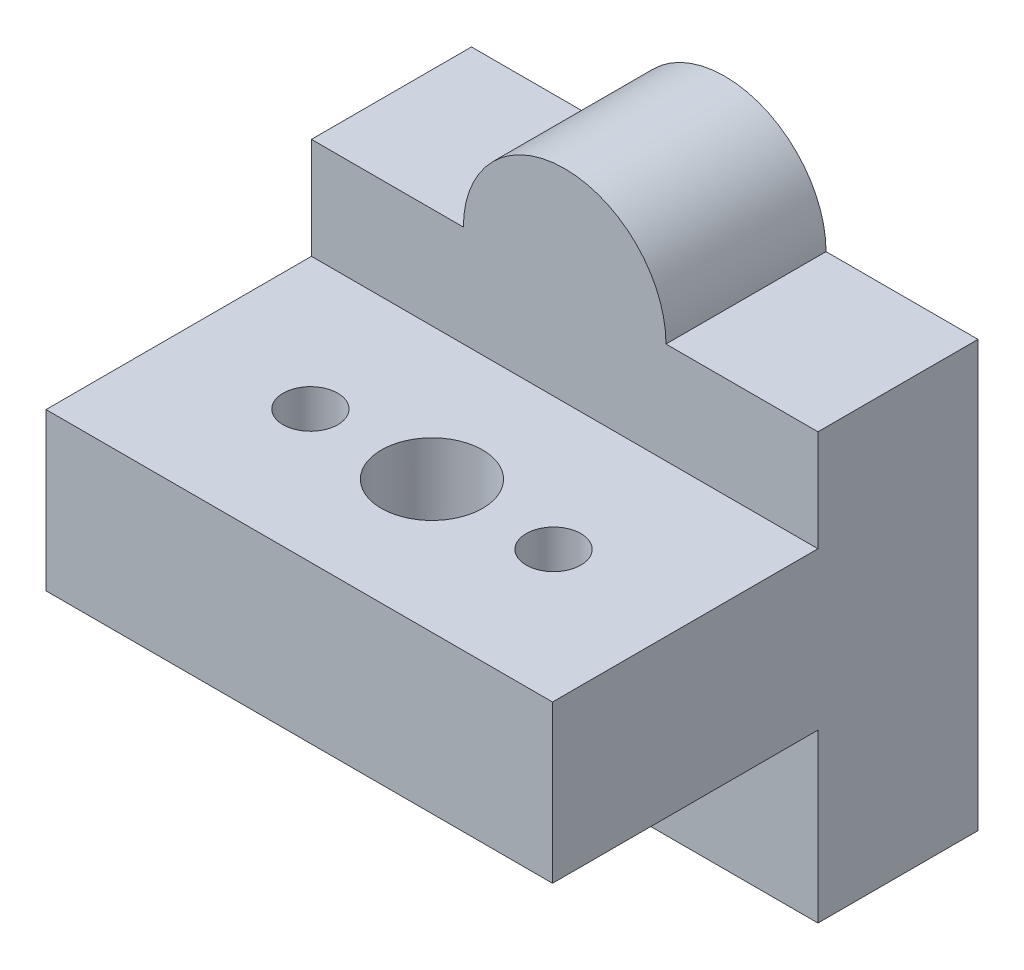
ISO-10303-21;
HEADER;
FILE_DESCRIPTION(('STEP AP214'),'2;1');
FILE_NAME('part.step','',(''),(''),'','','');
FILE_SCHEMA(('AUTOMOTIVE_DESIGN { 1 0 10303 214 1 1 1 1 }'));
ENDSEC;
DATA;
#1=APPLICATION_CONTEXT('core data for automotive mechanical design processes');
#2=APPLICATION_PROTOCOL_DEFINITION('international standard','automotive_design',2000,#1);
#3=PRODUCT_CONTEXT('',#1,'mechanical');
#4=PRODUCT('Part','Part','',(#3));
#5=PRODUCT_RELATED_PRODUCT_CATEGORY('part','',(#4));
#6=PRODUCT_DEFINITION_FORMATION('','',#4);
#7=PRODUCT_DEFINITION_CONTEXT('part definition',#1,'design');
#8=PRODUCT_DEFINITION('design','',#6,#7);
#9=PRODUCT_DEFINITION_SHAPE('','',#8);
#10=(LENGTH_UNIT() NAMED_UNIT(*) SI_UNIT(.MILLI.,.METRE.));
#11=(NAMED_UNIT(*) PLANE_ANGLE_UNIT() SI_UNIT($,.RADIAN.));
#12=(NAMED_UNIT(*) SI_UNIT($,.STERADIAN.) SOLID_ANGLE_UNIT());
#13=UNCERTAINTY_MEASURE_WITH_UNIT(LENGTH_MEASURE(1.E-05),#10,'distance_accuracy_value','');
#14=(GEOMETRIC_REPRESENTATION_CONTEXT(3) GLOBAL_UNCERTAINTY_ASSIGNED_CONTEXT((#13)) GLOBAL_UNIT_ASSIGNED_CONTEXT((#10,
#11,#12)) REPRESENTATION_CONTEXT('',''));
#15=CARTESIAN_POINT('',(0.,0.,0.));
#16=DIRECTION('',(0.,0.,1.));
#17=DIRECTION('',(1.,0.,0.));
#18=AXIS2_PLACEMENT_3D('',#15,#16,#17);
#19=CARTESIAN_POINT('',(6.00015,5.50000001,14.45));
#20=DIRECTION('',(0.,-1.,0.));
#21=DIRECTION('',(1.,0.,0.));
#22=AXIS2_PLACEMENT_3D('',#19,#20,#21);
#23=CYLINDRICAL_SURFACE('',#22,1.349845);
#24=CARTESIAN_POINT('',(6.00015,5.50000001,14.45));
#25=DIRECTION('',(0.,-1.,0.));
#26=DIRECTION('',(1.,0.,0.));
#27=AXIS2_PLACEMENT_3D('',#24,#25,#26);
#28=CIRCLE('',#27,1.349845);
#29=CARTESIAN_POINT('',(7.34999500000001,5.50000001,14.45));
#30=VERTEX_POINT('',#29);
#31=EDGE_CURVE('E251',#30,#30,#28,.F.);
#32=ORIENTED_EDGE('',*,*,#31,.T.);
#33=EDGE_LOOP('',(#32));
#34=FACE_BOUND('',#33,.T.);
#35=CARTESIAN_POINT('',(6.00015,0.250000009999998,14.45));
#36=DIRECTION('',(0.,-1.,0.));
#37=DIRECTION('',(1.,0.,0.));
#38=AXIS2_PLACEMENT_3D('',#35,#36,#37);
#39=CIRCLE('',#38,1.349845);
#40=CARTESIAN_POINT('',(7.34999500000001,0.250000009999999,14.45));
#41=VERTEX_POINT('',#40);
#42=EDGE_CURVE('E436',#41,#41,#39,.F.);
#43=ORIENTED_EDGE('',*,*,#42,.F.);
#44=EDGE_LOOP('',(#43));
#45=FACE_BOUND('',#44,.T.);
#46=ADVANCED_FACE('F140',(#34,#45),#23,.F.);
#47=CARTESIAN_POINT('',(0.,-2.24999999,0.));
#48=DIRECTION('',(0.,-1.,0.));
#49=DIRECTION('',(1.,0.,0.));
#50=AXIS2_PLACEMENT_3D('',#47,#48,#49);
#51=PLANE('',#50);
#52=CARTESIAN_POINT('',(-6.00015,-2.24999999,14.45));
#53=DIRECTION('',(0.,-1.,0.));
#54=DIRECTION('',(1.,0.,0.));
#55=AXIS2_PLACEMENT_3D('',#52,#53,#54);
#56=CIRCLE('',#55,2.6999438);
#57=CARTESIAN_POINT('',(-3.30020619999999,-2.24999999,14.45));
#58=VERTEX_POINT('',#57);
#59=EDGE_CURVE('E456',#58,#58,#56,.F.);
#60=ORIENTED_EDGE('',*,*,#59,.T.);
#61=EDGE_LOOP('',(#60));
#62=FACE_BOUND('',#61,.T.);
#63=CARTESIAN_POINT('',(0.,-2.24999999,14.45));
#64=DIRECTION('',(0.,1.,0.));
#65=DIRECTION('',(-1.,0.,0.));
#66=AXIS2_PLACEMENT_3D('',#63,#64,#65);
#67=CIRCLE('',#66,2.499995);
#68=CARTESIAN_POINT('',(-2.499995,-2.24999999,14.45));
#69=VERTEX_POINT('',#68);
#70=EDGE_CURVE('E438',#69,#69,#67,.T.);
#71=ORIENTED_EDGE('',*,*,#70,.T.);
#72=EDGE_LOOP('',(#71));
#73=FACE_BOUND('',#72,.T.);
#74=DIRECTION('',(-1.,0.,0.));
#75=VECTOR('',#74,1.);
#76=CARTESIAN_POINT('',(12.5,-2.24999999,21.));
#77=LINE('',#76,#75);
#78=CARTESIAN_POINT('',(12.5,-2.24999999,21.));
#79=VERTEX_POINT('',#78);
#80=CARTESIAN_POINT('',(-12.5,-2.24999999,21.));
#81=VERTEX_POINT('',#80);
#82=EDGE_CURVE('E258',#79,#81,#77,.T.);
#83=ORIENTED_EDGE('',*,*,#82,.T.);
#84=DIRECTION('',(0.,0.,1.));
#85=VECTOR('',#84,1.);
#86=CARTESIAN_POINT('',(-12.5,-2.24999999,7.9));
#87=LINE('',#86,#85);
#88=CARTESIAN_POINT('',(-12.5,-2.24999999,7.9));
#89=VERTEX_POINT('',#88);
#90=EDGE_CURVE('E234',#89,#81,#87,.T.);
#91=ORIENTED_EDGE('',*,*,#90,.F.);
#92=DIRECTION('',(-1.,0.,0.));
#93=VECTOR('',#92,1.);
#94=CARTESIAN_POINT('',(12.5,-2.24999999,7.9));
#95=LINE('',#94,#93);
#96=CARTESIAN_POINT('',(12.5,-2.24999999,7.9));
#97=VERTEX_POINT('',#96);
#98=EDGE_CURVE('E248',#97,#89,#95,.T.);
#99=ORIENTED_EDGE('',*,*,#98,.F.);
#100=DIRECTION('',(0.,0.,1.));
#101=VECTOR('',#100,1.);
#102=CARTESIAN_POINT('',(12.5,-2.24999999,7.9));
#103=LINE('',#102,#101);
#104=EDGE_CURVE('E244',#97,#79,#103,.T.);
#105=ORIENTED_EDGE('',*,*,#104,.T.);
#106=EDGE_LOOP('',(#83,#91,#99,#105));
#107=FACE_BOUND('',#106,.T.);
#108=CARTESIAN_POINT('',(6.00015,-2.24999999,14.45));
#109=DIRECTION('',(0.,-1.,0.));
#110=DIRECTION('',(1.,0.,0.));
#111=AXIS2_PLACEMENT_3D('',#108,#109,#110);
#112=CIRCLE('',#111,2.6999438);
#113=CARTESIAN_POINT('',(8.70009380000001,-2.24999999,14.45));
#114=VERTEX_POINT('',#113);
#115=EDGE_CURVE('E445',#114,#114,#112,.F.);
#116=ORIENTED_EDGE('',*,*,#115,.T.);
#117=EDGE_LOOP('',(#116));
#118=FACE_BOUND('',#117,.T.);
#119=ADVANCED_FACE('F374',(#62,#73,#107,#118),#51,.T.);
#120=CARTESIAN_POINT('',(-6.00015,21.24800001,14.45));
#121=DIRECTION('',(0.,-1.,0.));
#122=DIRECTION('',(1.,0.,0.));
#123=AXIS2_PLACEMENT_3D('',#120,#121,#122);
#124=CYLINDRICAL_SURFACE('',#123,1.349845);
#125=CARTESIAN_POINT('',(-6.00015,5.50000001,14.45));
#126=DIRECTION('',(0.,-1.,0.));
#127=DIRECTION('',(1.,0.,0.));
#128=AXIS2_PLACEMENT_3D('',#125,#126,#127);
#129=CIRCLE('',#128,1.349845);
#130=CARTESIAN_POINT('',(-4.650305,5.50000001,14.45));
#131=VERTEX_POINT('',#130);
#132=EDGE_CURVE('E261',#131,#131,#129,.F.);
#133=ORIENTED_EDGE('',*,*,#132,.T.);
#134=EDGE_LOOP('',(#133));
#135=FACE_BOUND('',#134,.T.);
#136=CARTESIAN_POINT('',(-6.00015,0.250000009999998,14.45));
#137=DIRECTION('',(0.,-1.,0.));
#138=DIRECTION('',(1.,0.,0.));
#139=AXIS2_PLACEMENT_3D('',#136,#137,#138);
#140=CIRCLE('',#139,1.349845);
#141=CARTESIAN_POINT('',(-4.650305,0.250000009999998,14.45));
#142=VERTEX_POINT('',#141);
#143=EDGE_CURVE('E451',#142,#142,#140,.F.);
#144=ORIENTED_EDGE('',*,*,#143,.F.);
#145=EDGE_LOOP('',(#144));
#146=FACE_BOUND('',#145,.T.);
#147=ADVANCED_FACE('F380',(#135,#146),#124,.F.);
#148=CARTESIAN_POINT('',(0.,10.5,7.9));
#149=DIRECTION('',(0.,0.,1.));
#150=DIRECTION('',(1.,0.,0.));
#151=AXIS2_PLACEMENT_3D('',#148,#149,#150);
#152=PLANE('',#151);
#153=DIRECTION('',(0.,1.,0.));
#154=VECTOR('',#153,1.);
#155=CARTESIAN_POINT('',(12.5,-10.5,7.9));
#156=LINE('',#155,#154);
#157=CARTESIAN_POINT('',(12.5,-10.5,7.9));
#158=VERTEX_POINT('',#157);
#159=EDGE_CURVE('E164',#158,#97,#156,.T.);
#160=ORIENTED_EDGE('',*,*,#159,.T.);
#161=ORIENTED_EDGE('',*,*,#98,.T.);
#162=DIRECTION('',(0.,-1.,0.));
#163=VECTOR('',#162,1.);
#164=CARTESIAN_POINT('',(-12.5,-10.5,7.9));
#165=LINE('',#164,#163);
#166=CARTESIAN_POINT('',(-12.5,-10.5,7.9));
#167=VERTEX_POINT('',#166);
#168=EDGE_CURVE('E272',#89,#167,#165,.T.);
#169=ORIENTED_EDGE('',*,*,#168,.T.);
#170=DIRECTION('',(1.,0.,0.));
#171=VECTOR('',#170,1.);
#172=CARTESIAN_POINT('',(12.5,-10.5,7.9));
#173=LINE('',#172,#171);
#174=EDGE_CURVE('E271',#167,#158,#173,.T.);
#175=ORIENTED_EDGE('',*,*,#174,.T.);
#176=EDGE_LOOP('',(#160,#161,#169,#175));
#177=FACE_BOUND('',#176,.T.);
#178=ADVANCED_FACE('F385',(#177),#152,.T.);
#179=CARTESIAN_POINT('',(-12.5,-10.5,7.9));
#180=DIRECTION('',(1.,0.,0.));
#181=DIRECTION('',(0.,0.,-1.));
#182=AXIS2_PLACEMENT_3D('',#179,#180,#181);
#183=PLANE('',#182);
#184=DIRECTION('',(0.,-1.,0.));
#185=VECTOR('',#184,1.);
#186=CARTESIAN_POINT('',(-12.5,-10.5,0.));
#187=LINE('',#186,#185);
#188=CARTESIAN_POINT('',(-12.5,10.5,0.));
#189=VERTEX_POINT('',#188);
#190=CARTESIAN_POINT('',(-12.5,-10.5,0.));
#191=VERTEX_POINT('',#190);
#192=EDGE_CURVE('E288',#189,#191,#187,.T.);
#193=ORIENTED_EDGE('',*,*,#192,.T.);
#194=DIRECTION('',(0.,0.,-1.));
#195=VECTOR('',#194,1.);
#196=CARTESIAN_POINT('',(-12.5,-10.5,7.9));
#197=LINE('',#196,#195);
#198=EDGE_CURVE('E12',#167,#191,#197,.T.);
#199=ORIENTED_EDGE('',*,*,#198,.F.);
#200=ORIENTED_EDGE('',*,*,#168,.F.);
#201=ORIENTED_EDGE('',*,*,#90,.T.);
#202=DIRECTION('',(0.,-1.,0.));
#203=VECTOR('',#202,1.);
#204=CARTESIAN_POINT('',(-12.5,5.50000001,21.));
#205=LINE('',#204,#203);
#206=CARTESIAN_POINT('',(-12.5,5.50000001,21.));
#207=VERTEX_POINT('',#206);
#208=EDGE_CURVE('E230',#207,#81,#205,.T.);
#209=ORIENTED_EDGE('',*,*,#208,.F.);
#210=DIRECTION('',(0.,0.,1.));
#211=VECTOR('',#210,1.);
#212=CARTESIAN_POINT('',(-12.5,5.50000001,7.9));
#213=LINE('',#212,#211);
#214=CARTESIAN_POINT('',(-12.5,5.50000001,7.9));
#215=VERTEX_POINT('',#214);
#216=EDGE_CURVE('E218',#215,#207,#213,.T.);
#217=ORIENTED_EDGE('',*,*,#216,.F.);
#218=CARTESIAN_POINT('',(-12.5,10.5,7.9));
#219=VERTEX_POINT('',#218);
#220=EDGE_CURVE('E268',#219,#215,#165,.T.);
#221=ORIENTED_EDGE('',*,*,#220,.F.);
#222=DIRECTION('',(0.,0.,-1.));
#223=VECTOR('',#222,1.);
#224=CARTESIAN_POINT('',(-12.5,10.5,7.9));
#225=LINE('',#224,#223);
#226=EDGE_CURVE('E287',#219,#189,#225,.T.);
#227=ORIENTED_EDGE('',*,*,#226,.T.);
#228=EDGE_LOOP('',(#193,#199,#200,#201,#209,#217,#221,#227));
#229=FACE_BOUND('',#228,.T.);
#230=ADVANCED_FACE('F142',(#229),#183,.F.);
#231=CARTESIAN_POINT('',(12.5,-10.5,7.9));
#232=DIRECTION('',(0.,1.,0.));
#233=DIRECTION('',(-1.,0.,0.));
#234=AXIS2_PLACEMENT_3D('',#231,#232,#233);
#235=PLANE('',#234);
#236=DIRECTION('',(1.,0.,0.));
#237=VECTOR('',#236,1.);
#238=CARTESIAN_POINT('',(12.5,-10.5,0.));
#239=LINE('',#238,#237);
#240=CARTESIAN_POINT('',(12.5,-10.5,0.));
#241=VERTEX_POINT('',#240);
#242=EDGE_CURVE('E291',#191,#241,#239,.T.);
#243=ORIENTED_EDGE('',*,*,#242,.T.);
#244=DIRECTION('',(0.,0.,-1.));
#245=VECTOR('',#244,1.);
#246=CARTESIAN_POINT('',(12.5,-10.5,7.9));
#247=LINE('',#246,#245);
#248=EDGE_CURVE('E149',#158,#241,#247,.T.);
#249=ORIENTED_EDGE('',*,*,#248,.F.);
#250=ORIENTED_EDGE('',*,*,#174,.F.);
#251=ORIENTED_EDGE('',*,*,#198,.T.);
#252=EDGE_LOOP('',(#243,#249,#250,#251));
#253=FACE_BOUND('',#252,.T.);
#254=ADVANCED_FACE('F394',(#253),#235,.F.);
#255=CARTESIAN_POINT('',(12.5,-10.5,7.9));
#256=DIRECTION('',(-1.,0.,0.));
#257=DIRECTION('',(0.,0.,1.));
#258=AXIS2_PLACEMENT_3D('',#255,#256,#257);
#259=PLANE('',#258);
#260=DIRECTION('',(0.,1.,0.));
#261=VECTOR('',#260,1.);
#262=CARTESIAN_POINT('',(12.5,-10.5,0.));
#263=LINE('',#262,#261);
#264=CARTESIAN_POINT('',(12.5,10.5,0.));
#265=VERTEX_POINT('',#264);
#266=EDGE_CURVE('E294',#241,#265,#263,.T.);
#267=ORIENTED_EDGE('',*,*,#266,.T.);
#268=DIRECTION('',(0.,0.,-1.));
#269=VECTOR('',#268,1.);
#270=CARTESIAN_POINT('',(12.5,10.5,7.9));
#271=LINE('',#270,#269);
#272=CARTESIAN_POINT('',(12.5,10.5,7.9));
#273=VERTEX_POINT('',#272);
#274=EDGE_CURVE('E317',#273,#265,#271,.T.);
#275=ORIENTED_EDGE('',*,*,#274,.F.);
#276=CARTESIAN_POINT('',(12.5,5.50000001,7.9));
#277=VERTEX_POINT('',#276);
#278=EDGE_CURVE('E275',#277,#273,#156,.T.);
#279=ORIENTED_EDGE('',*,*,#278,.F.);
#280=DIRECTION('',(0.,0.,1.));
#281=VECTOR('',#280,1.);
#282=CARTESIAN_POINT('',(12.5,5.50000001,7.9));
#283=LINE('',#282,#281);
#284=CARTESIAN_POINT('',(12.5,5.50000001,21.));
#285=VERTEX_POINT('',#284);
#286=EDGE_CURVE('E240',#277,#285,#283,.T.);
#287=ORIENTED_EDGE('',*,*,#286,.T.);
#288=DIRECTION('',(0.,-1.,0.));
#289=VECTOR('',#288,1.);
#290=CARTESIAN_POINT('',(12.5,5.50000001,21.));
#291=LINE('',#290,#289);
#292=EDGE_CURVE('E239',#285,#79,#291,.T.);
#293=ORIENTED_EDGE('',*,*,#292,.T.);
#294=ORIENTED_EDGE('',*,*,#104,.F.);
#295=ORIENTED_EDGE('',*,*,#159,.F.);
#296=ORIENTED_EDGE('',*,*,#248,.T.);
#297=EDGE_LOOP('',(#267,#275,#279,#287,#293,#294,#295,#296));
#298=FACE_BOUND('',#297,.T.);
#299=ADVANCED_FACE('F325',(#298),#259,.F.);
#300=CARTESIAN_POINT('',(12.5,10.5,7.9));
#301=DIRECTION('',(0.,-1.,0.));
#302=DIRECTION('',(1.,0.,0.));
#303=AXIS2_PLACEMENT_3D('',#300,#301,#302);
#304=PLANE('',#303);
#305=DIRECTION('',(-1.,0.,0.));
#306=VECTOR('',#305,1.);
#307=CARTESIAN_POINT('',(12.5,10.5,0.));
#308=LINE('',#307,#306);
#309=CARTESIAN_POINT('',(5.,10.5,0.));
#310=VERTEX_POINT('',#309);
#311=EDGE_CURVE('E297',#265,#310,#308,.T.);
#312=ORIENTED_EDGE('',*,*,#311,.T.);
#313=DIRECTION('',(0.,0.,-1.));
#314=VECTOR('',#313,1.);
#315=CARTESIAN_POINT('',(5.,10.5,7.9));
#316=LINE('',#315,#314);
#317=CARTESIAN_POINT('',(5.,10.5,7.9));
#318=VERTEX_POINT('',#317);
#319=EDGE_CURVE('E313',#318,#310,#316,.T.);
#320=ORIENTED_EDGE('',*,*,#319,.F.);
#321=DIRECTION('',(-1.,0.,0.));
#322=VECTOR('',#321,1.);
#323=CARTESIAN_POINT('',(12.5,10.5,7.9));
#324=LINE('',#323,#322);
#325=EDGE_CURVE('E278',#273,#318,#324,.T.);
#326=ORIENTED_EDGE('',*,*,#325,.F.);
#327=ORIENTED_EDGE('',*,*,#274,.T.);
#328=EDGE_LOOP('',(#312,#320,#326,#327));
#329=FACE_BOUND('',#328,.T.);
#330=ADVANCED_FACE('F338',(#329),#304,.F.);
#331=CARTESIAN_POINT('',(0.,10.5,7.9));
#332=DIRECTION('',(0.,0.,-1.));
#333=DIRECTION('',(-1.,0.,0.));
#334=AXIS2_PLACEMENT_3D('',#331,#332,#333);
#335=CYLINDRICAL_SURFACE('',#334,5.);
#336=CARTESIAN_POINT('',(0.,10.5,0.));
#337=DIRECTION('',(0.,0.,1.));
#338=DIRECTION('',(1.,0.,0.));
#339=AXIS2_PLACEMENT_3D('',#336,#337,#338);
#340=CIRCLE('',#339,5.);
#341=CARTESIAN_POINT('',(-5.,10.5,0.));
#342=VERTEX_POINT('',#341);
#343=EDGE_CURVE('E300',#310,#342,#340,.T.);
#344=ORIENTED_EDGE('',*,*,#343,.T.);
#345=DIRECTION('',(0.,0.,-1.));
#346=VECTOR('',#345,1.);
#347=CARTESIAN_POINT('',(-5.,10.5,7.9));
#348=LINE('',#347,#346);
#349=CARTESIAN_POINT('',(-5.,10.5,7.9));
#350=VERTEX_POINT('',#349);
#351=EDGE_CURVE('E309',#350,#342,#348,.T.);
#352=ORIENTED_EDGE('',*,*,#351,.F.);
#353=CARTESIAN_POINT('',(0.,10.5,7.9));
#354=DIRECTION('',(0.,0.,1.));
#355=DIRECTION('',(1.,0.,0.));
#356=AXIS2_PLACEMENT_3D('',#353,#354,#355);
#357=CIRCLE('',#356,5.);
#358=EDGE_CURVE('E281',#318,#350,#357,.T.);
#359=ORIENTED_EDGE('',*,*,#358,.F.);
#360=ORIENTED_EDGE('',*,*,#319,.T.);
#361=EDGE_LOOP('',(#344,#352,#359,#360));
#362=FACE_BOUND('',#361,.T.);
#363=ADVANCED_FACE('F342',(#362),#335,.T.);
#364=CARTESIAN_POINT('',(-5.,10.5,7.9));
#365=DIRECTION('',(0.,-1.,0.));
#366=DIRECTION('',(1.,0.,0.));
#367=AXIS2_PLACEMENT_3D('',#364,#365,#366);
#368=PLANE('',#367);
#369=DIRECTION('',(-1.,0.,0.));
#370=VECTOR('',#369,1.);
#371=CARTESIAN_POINT('',(-5.,10.5,0.));
#372=LINE('',#371,#370);
#373=EDGE_CURVE('E303',#342,#189,#372,.T.);
#374=ORIENTED_EDGE('',*,*,#373,.T.);
#375=ORIENTED_EDGE('',*,*,#226,.F.);
#376=DIRECTION('',(-1.,0.,0.));
#377=VECTOR('',#376,1.);
#378=CARTESIAN_POINT('',(-5.,10.5,7.9));
#379=LINE('',#378,#377);
#380=EDGE_CURVE('E284',#350,#219,#379,.T.);
#381=ORIENTED_EDGE('',*,*,#380,.F.);
#382=ORIENTED_EDGE('',*,*,#351,.T.);
#383=EDGE_LOOP('',(#374,#375,#381,#382));
#384=FACE_BOUND('',#383,.T.);
#385=ADVANCED_FACE('F384',(#384),#368,.F.);
#386=DIRECTION('',(-1.,0.,0.));
#387=VECTOR('',#386,1.);
#388=CARTESIAN_POINT('',(12.5,5.50000001,7.9));
#389=LINE('',#388,#387);
#390=EDGE_CURVE('E156',#277,#215,#389,.T.);
#391=ORIENTED_EDGE('',*,*,#390,.F.);
#392=ORIENTED_EDGE('',*,*,#278,.T.);
#393=ORIENTED_EDGE('',*,*,#325,.T.);
#394=ORIENTED_EDGE('',*,*,#358,.T.);
#395=ORIENTED_EDGE('',*,*,#380,.T.);
#396=ORIENTED_EDGE('',*,*,#220,.T.);
#397=EDGE_LOOP('',(#391,#392,#393,#394,#395,#396));
#398=FACE_BOUND('',#397,.T.);
#399=ADVANCED_FACE('F345',(#398),#152,.T.);
#400=CARTESIAN_POINT('',(0.,10.5,0.));
#401=DIRECTION('',(0.,0.,1.));
#402=DIRECTION('',(1.,0.,0.));
#403=AXIS2_PLACEMENT_3D('',#400,#401,#402);
#404=PLANE('',#403);
#405=ORIENTED_EDGE('',*,*,#192,.F.);
#406=ORIENTED_EDGE('',*,*,#373,.F.);
#407=ORIENTED_EDGE('',*,*,#343,.F.);
#408=ORIENTED_EDGE('',*,*,#311,.F.);
#409=ORIENTED_EDGE('',*,*,#266,.F.);
#410=ORIENTED_EDGE('',*,*,#242,.F.);
#411=EDGE_LOOP('',(#405,#406,#407,#408,#409,#410));
#412=FACE_BOUND('',#411,.T.);
#413=ADVANCED_FACE('F333',(#412),#404,.F.);
#414=CARTESIAN_POINT('',(0.,5.50000001,0.));
#415=DIRECTION('',(0.,-1.,0.));
#416=DIRECTION('',(1.,0.,0.));
#417=AXIS2_PLACEMENT_3D('',#414,#415,#416);
#418=PLANE('',#417);
#419=ORIENTED_EDGE('',*,*,#132,.F.);
#420=EDGE_LOOP('',(#419));
#421=FACE_BOUND('',#420,.T.);
#422=CARTESIAN_POINT('',(0.,5.50000001,14.45));
#423=DIRECTION('',(0.,-1.,0.));
#424=DIRECTION('',(1.,0.,0.));
#425=AXIS2_PLACEMENT_3D('',#422,#423,#424);
#426=CIRCLE('',#425,2.499995);
#427=CARTESIAN_POINT('',(2.49999500000001,5.50000001,14.45));
#428=VERTEX_POINT('',#427);
#429=EDGE_CURVE('E443',#428,#428,#426,.F.);
#430=ORIENTED_EDGE('',*,*,#429,.F.);
#431=EDGE_LOOP('',(#430));
#432=FACE_BOUND('',#431,.T.);
#433=ORIENTED_EDGE('',*,*,#31,.F.);
#434=EDGE_LOOP('',(#433));
#435=FACE_BOUND('',#434,.T.);
#436=DIRECTION('',(-1.,0.,0.));
#437=VECTOR('',#436,1.);
#438=CARTESIAN_POINT('',(12.5,5.50000001,21.));
#439=LINE('',#438,#437);
#440=EDGE_CURVE('E223',#285,#207,#439,.T.);
#441=ORIENTED_EDGE('',*,*,#440,.F.);
#442=ORIENTED_EDGE('',*,*,#286,.F.);
#443=ORIENTED_EDGE('',*,*,#390,.T.);
#444=ORIENTED_EDGE('',*,*,#216,.T.);
#445=EDGE_LOOP('',(#441,#442,#443,#444));
#446=FACE_BOUND('',#445,.T.);
#447=ADVANCED_FACE('F220',(#421,#432,#435,#446),#418,.F.);
#448=CARTESIAN_POINT('',(12.5,5.50000001,21.));
#449=DIRECTION('',(0.,0.,1.));
#450=DIRECTION('',(1.,0.,0.));
#451=AXIS2_PLACEMENT_3D('',#448,#449,#450);
#452=PLANE('',#451);
#453=ORIENTED_EDGE('',*,*,#82,.F.);
#454=ORIENTED_EDGE('',*,*,#292,.F.);
#455=ORIENTED_EDGE('',*,*,#440,.T.);
#456=ORIENTED_EDGE('',*,*,#208,.T.);
#457=EDGE_LOOP('',(#453,#454,#455,#456));
#458=FACE_BOUND('',#457,.T.);
#459=ADVANCED_FACE('F242',(#458),#452,.T.);
#460=CARTESIAN_POINT('',(0.,21.24800001,14.45));
#461=DIRECTION('',(0.,-1.,0.));
#462=DIRECTION('',(1.,0.,0.));
#463=AXIS2_PLACEMENT_3D('',#460,#461,#462);
#464=CYLINDRICAL_SURFACE('',#463,2.499995);
#465=ORIENTED_EDGE('',*,*,#70,.F.);
#466=EDGE_LOOP('',(#465));
#467=FACE_BOUND('',#466,.T.);
#468=ORIENTED_EDGE('',*,*,#429,.T.);
#469=EDGE_LOOP('',(#468));
#470=FACE_BOUND('',#469,.T.);
#471=ADVANCED_FACE('F358',(#467,#470),#464,.F.);
#472=CARTESIAN_POINT('',(-6.00015,0.250000009999998,14.45));
#473=DIRECTION('',(0.,-1.,0.));
#474=DIRECTION('',(1.,0.,0.));
#475=AXIS2_PLACEMENT_3D('',#472,#473,#474);
#476=CYLINDRICAL_SURFACE('',#475,2.6999438);
#477=CARTESIAN_POINT('',(-6.00015,0.250000009999998,14.45));
#478=DIRECTION('',(0.,-1.,0.));
#479=DIRECTION('',(1.,0.,0.));
#480=AXIS2_PLACEMENT_3D('',#477,#478,#479);
#481=CIRCLE('',#480,2.6999438);
#482=CARTESIAN_POINT('',(-3.30020619999999,0.250000009999998,14.45));
#483=VERTEX_POINT('',#482);
#484=EDGE_CURVE('E452',#483,#483,#481,.F.);
#485=ORIENTED_EDGE('',*,*,#484,.T.);
#486=EDGE_LOOP('',(#485));
#487=FACE_BOUND('',#486,.T.);
#488=ORIENTED_EDGE('',*,*,#59,.F.);
#489=EDGE_LOOP('',(#488));
#490=FACE_BOUND('',#489,.T.);
#491=ADVANCED_FACE('F371',(#487,#490),#476,.F.);
#492=CARTESIAN_POINT('',(0.,0.250000009999998,0.));
#493=DIRECTION('',(0.,-1.,0.));
#494=DIRECTION('',(1.,0.,0.));
#495=AXIS2_PLACEMENT_3D('',#492,#493,#494);
#496=PLANE('',#495);
#497=ORIENTED_EDGE('',*,*,#484,.F.);
#498=EDGE_LOOP('',(#497));
#499=FACE_BOUND('',#498,.T.);
#500=ORIENTED_EDGE('',*,*,#143,.T.);
#501=EDGE_LOOP('',(#500));
#502=FACE_BOUND('',#501,.T.);
#503=ADVANCED_FACE('F416',(#499,#502),#496,.T.);
#504=CARTESIAN_POINT('',(6.00015,0.250000009999998,14.45));
#505=DIRECTION('',(0.,-1.,0.));
#506=DIRECTION('',(1.,0.,0.));
#507=AXIS2_PLACEMENT_3D('',#504,#505,#506);
#508=CYLINDRICAL_SURFACE('',#507,2.6999438);
#509=CARTESIAN_POINT('',(6.00015,0.250000009999998,14.45));
#510=DIRECTION('',(0.,-1.,0.));
#511=DIRECTION('',(1.,0.,0.));
#512=AXIS2_PLACEMENT_3D('',#509,#510,#511);
#513=CIRCLE('',#512,2.6999438);
#514=CARTESIAN_POINT('',(8.70009380000001,0.250000009999999,14.45));
#515=VERTEX_POINT('',#514);
#516=EDGE_CURVE('E433',#515,#515,#513,.F.);
#517=ORIENTED_EDGE('',*,*,#516,.T.);
#518=EDGE_LOOP('',(#517));
#519=FACE_BOUND('',#518,.T.);
#520=ORIENTED_EDGE('',*,*,#115,.F.);
#521=EDGE_LOOP('',(#520));
#522=FACE_BOUND('',#521,.T.);
#523=ADVANCED_FACE('F420',(#519,#522),#508,.F.);
#524=CARTESIAN_POINT('',(0.,0.250000009999998,0.));
#525=DIRECTION('',(0.,-1.,0.));
#526=DIRECTION('',(1.,0.,0.));
#527=AXIS2_PLACEMENT_3D('',#524,#525,#526);
#528=PLANE('',#527);
#529=ORIENTED_EDGE('',*,*,#516,.F.);
#530=EDGE_LOOP('',(#529));
#531=FACE_BOUND('',#530,.T.);
#532=ORIENTED_EDGE('',*,*,#42,.T.);
#533=EDGE_LOOP('',(#532));
#534=FACE_BOUND('',#533,.T.);
#535=ADVANCED_FACE('F424',(#531,#534),#528,.T.);
#536=CLOSED_SHELL('',(#46,#119,#147,#178,#230,#254,#299,#330,#363,#385,#399,#413,#447,#459,#471,
#491,#503,#523,#535));
#537=MANIFOLD_SOLID_BREP('B2',#536);
#538=ADVANCED_BREP_SHAPE_REPRESENTATION('',(#18,#537),#14);
#539=SHAPE_DEFINITION_REPRESENTATION(#9,#538);
ENDSEC;
END-ISO-10303-21;
